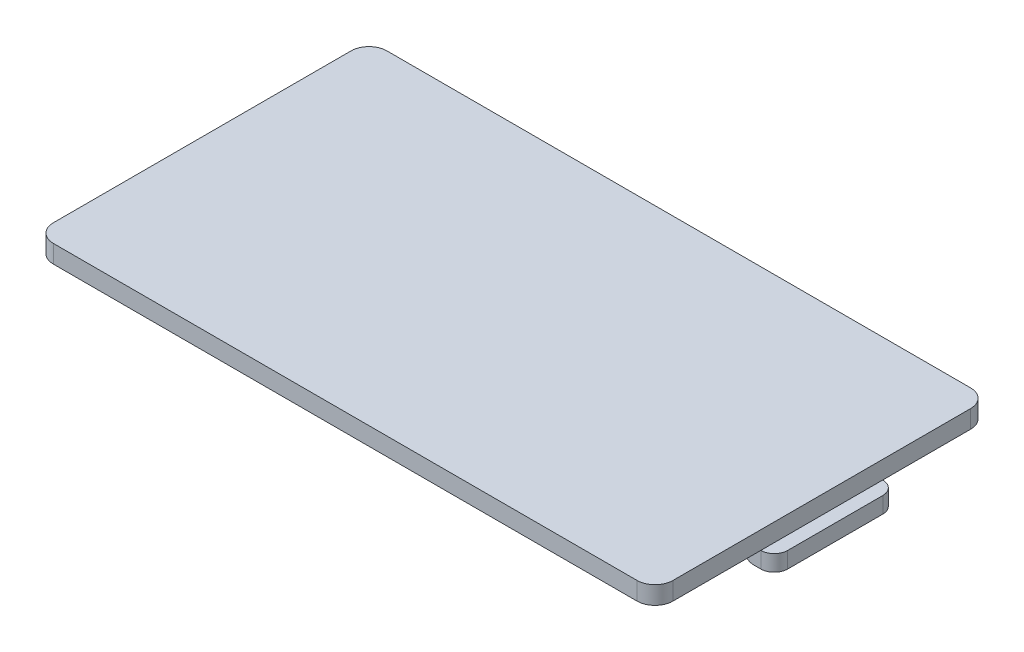
ISO-10303-21;
HEADER;
FILE_DESCRIPTION(('STEP AP214'),'2;1');
FILE_NAME('part.step','',(''),(''),'','','');
FILE_SCHEMA(('AUTOMOTIVE_DESIGN { 1 0 10303 214 1 1 1 1 }'));
ENDSEC;
DATA;
#1=APPLICATION_CONTEXT('core data for automotive mechanical design processes');
#2=APPLICATION_PROTOCOL_DEFINITION('international standard','automotive_design',2000,#1);
#3=PRODUCT_CONTEXT('',#1,'mechanical');
#4=PRODUCT('Part','Part','',(#3));
#5=PRODUCT_RELATED_PRODUCT_CATEGORY('part','',(#4));
#6=PRODUCT_DEFINITION_FORMATION('','',#4);
#7=PRODUCT_DEFINITION_CONTEXT('part definition',#1,'design');
#8=PRODUCT_DEFINITION('design','',#6,#7);
#9=PRODUCT_DEFINITION_SHAPE('','',#8);
#10=(LENGTH_UNIT() NAMED_UNIT(*) SI_UNIT(.MILLI.,.METRE.));
#11=(NAMED_UNIT(*) PLANE_ANGLE_UNIT() SI_UNIT($,.RADIAN.));
#12=(NAMED_UNIT(*) SI_UNIT($,.STERADIAN.) SOLID_ANGLE_UNIT());
#13=UNCERTAINTY_MEASURE_WITH_UNIT(LENGTH_MEASURE(1.E-05),#10,'distance_accuracy_value','');
#14=(GEOMETRIC_REPRESENTATION_CONTEXT(3) GLOBAL_UNCERTAINTY_ASSIGNED_CONTEXT((#13)) GLOBAL_UNIT_ASSIGNED_CONTEXT((#10,
#11,#12)) REPRESENTATION_CONTEXT('',''));
#15=CARTESIAN_POINT('',(0.,0.,0.));
#16=DIRECTION('',(0.,0.,1.));
#17=DIRECTION('',(1.,0.,0.));
#18=AXIS2_PLACEMENT_3D('',#15,#16,#17);
#19=CARTESIAN_POINT('',(0.,0.,0.));
#20=DIRECTION('',(0.,1.,0.));
#21=DIRECTION('',(0.,0.,1.));
#22=AXIS2_PLACEMENT_3D('',#19,#20,#21);
#23=PLANE('',#22);
#24=DIRECTION('',(0.,0.,1.));
#25=VECTOR('',#24,1.);
#26=CARTESIAN_POINT('',(34.55,0.,0.));
#27=LINE('',#26,#25);
#28=CARTESIAN_POINT('',(34.55,0.,6.80000000000001));
#29=VERTEX_POINT('',#28);
#30=CARTESIAN_POINT('',(34.55,0.,16.6));
#31=VERTEX_POINT('',#30);
#32=EDGE_CURVE('E209',#29,#31,#27,.T.);
#33=ORIENTED_EDGE('',*,*,#32,.T.);
#34=CARTESIAN_POINT('',(32.55,0.,16.6));
#35=DIRECTION('',(0.,1.,0.));
#36=DIRECTION('',(0.,0.,1.));
#37=AXIS2_PLACEMENT_3D('',#34,#35,#36);
#38=CIRCLE('',#37,2.);
#39=CARTESIAN_POINT('',(32.55,0.,18.6));
#40=VERTEX_POINT('',#39);
#41=EDGE_CURVE('E235',#31,#40,#38,.F.);
#42=ORIENTED_EDGE('',*,*,#41,.T.);
#43=DIRECTION('',(1.,0.,0.));
#44=VECTOR('',#43,1.);
#45=CARTESIAN_POINT('',(0.,0.,18.6));
#46=LINE('',#45,#44);
#47=CARTESIAN_POINT('',(-32.55,0.,18.6));
#48=VERTEX_POINT('',#47);
#49=EDGE_CURVE('E192',#48,#40,#46,.T.);
#50=ORIENTED_EDGE('',*,*,#49,.F.);
#51=CARTESIAN_POINT('',(-32.55,0.,16.6));
#52=DIRECTION('',(0.,1.,0.));
#53=DIRECTION('',(0.,0.,1.));
#54=AXIS2_PLACEMENT_3D('',#51,#52,#53);
#55=CIRCLE('',#54,2.);
#56=CARTESIAN_POINT('',(-34.55,0.,16.6));
#57=VERTEX_POINT('',#56);
#58=EDGE_CURVE('E232',#48,#57,#55,.F.);
#59=ORIENTED_EDGE('',*,*,#58,.T.);
#60=DIRECTION('',(0.,0.,1.));
#61=VECTOR('',#60,1.);
#62=CARTESIAN_POINT('',(-34.55,0.,0.));
#63=LINE('',#62,#61);
#64=CARTESIAN_POINT('',(-34.55,0.,-16.6));
#65=VERTEX_POINT('',#64);
#66=EDGE_CURVE('E199',#65,#57,#63,.T.);
#67=ORIENTED_EDGE('',*,*,#66,.F.);
#68=CARTESIAN_POINT('',(-32.55,0.,-16.6));
#69=DIRECTION('',(0.,1.,0.));
#70=DIRECTION('',(0.,0.,1.));
#71=AXIS2_PLACEMENT_3D('',#68,#69,#70);
#72=CIRCLE('',#71,2.);
#73=CARTESIAN_POINT('',(-32.55,0.,-18.6));
#74=VERTEX_POINT('',#73);
#75=EDGE_CURVE('E229',#65,#74,#72,.F.);
#76=ORIENTED_EDGE('',*,*,#75,.T.);
#77=DIRECTION('',(1.,0.,0.));
#78=VECTOR('',#77,1.);
#79=CARTESIAN_POINT('',(0.,0.,-18.6));
#80=LINE('',#79,#78);
#81=CARTESIAN_POINT('',(32.55,0.,-18.6));
#82=VERTEX_POINT('',#81);
#83=EDGE_CURVE('E212',#74,#82,#80,.T.);
#84=ORIENTED_EDGE('',*,*,#83,.T.);
#85=CARTESIAN_POINT('',(32.55,0.,-16.6));
#86=DIRECTION('',(0.,1.,0.));
#87=DIRECTION('',(0.,0.,1.));
#88=AXIS2_PLACEMENT_3D('',#85,#86,#87);
#89=CIRCLE('',#88,2.);
#90=CARTESIAN_POINT('',(34.55,0.,-16.6));
#91=VERTEX_POINT('',#90);
#92=EDGE_CURVE('E226',#82,#91,#89,.F.);
#93=ORIENTED_EDGE('',*,*,#92,.T.);
#94=CARTESIAN_POINT('',(34.55,0.,-6.79999999999998));
#95=VERTEX_POINT('',#94);
#96=EDGE_CURVE('E177',#91,#95,#27,.T.);
#97=ORIENTED_EDGE('',*,*,#96,.T.);
#98=DIRECTION('',(-1.,0.,0.));
#99=VECTOR('',#98,1.);
#100=CARTESIAN_POINT('',(0.,0.,-6.79999999999997));
#101=LINE('',#100,#99);
#102=CARTESIAN_POINT('',(32.55,0.,-6.79999999999998));
#103=VERTEX_POINT('',#102);
#104=EDGE_CURVE('E153',#95,#103,#101,.T.);
#105=ORIENTED_EDGE('',*,*,#104,.T.);
#106=DIRECTION('',(0.,0.,1.));
#107=VECTOR('',#106,1.);
#108=CARTESIAN_POINT('',(32.55,0.,0.));
#109=LINE('',#108,#107);
#110=CARTESIAN_POINT('',(32.55,0.,6.80000000000001));
#111=VERTEX_POINT('',#110);
#112=EDGE_CURVE('E164',#103,#111,#109,.T.);
#113=ORIENTED_EDGE('',*,*,#112,.T.);
#114=DIRECTION('',(-1.,0.,0.));
#115=VECTOR('',#114,1.);
#116=CARTESIAN_POINT('',(0.,0.,6.80000000000001));
#117=LINE('',#116,#115);
#118=EDGE_CURVE('E179',#29,#111,#117,.T.);
#119=ORIENTED_EDGE('',*,*,#118,.F.);
#120=EDGE_LOOP('',(#33,#42,#50,#59,#67,#76,#84,#93,#97,#105,#113,#119));
#121=FACE_BOUND('',#120,.T.);
#122=CARTESIAN_POINT('',(-29.75,0.,-7.1));
#123=DIRECTION('',(0.,1.,0.));
#124=DIRECTION('',(0.,0.,1.));
#125=AXIS2_PLACEMENT_3D('',#122,#123,#124);
#126=CIRCLE('',#125,2.6);
#127=CARTESIAN_POINT('',(-29.75,0.,-4.5));
#128=VERTEX_POINT('',#127);
#129=EDGE_CURVE('E335',#128,#128,#126,.T.);
#130=ORIENTED_EDGE('',*,*,#129,.T.);
#131=EDGE_LOOP('',(#130));
#132=FACE_BOUND('',#131,.T.);
#133=CARTESIAN_POINT('',(-29.75,0.,7.1));
#134=DIRECTION('',(0.,1.,0.));
#135=DIRECTION('',(0.,0.,1.));
#136=AXIS2_PLACEMENT_3D('',#133,#134,#135);
#137=CIRCLE('',#136,2.6);
#138=CARTESIAN_POINT('',(-29.75,0.,9.7));
#139=VERTEX_POINT('',#138);
#140=EDGE_CURVE('E343',#139,#139,#137,.F.);
#141=ORIENTED_EDGE('',*,*,#140,.F.);
#142=EDGE_LOOP('',(#141));
#143=FACE_BOUND('',#142,.T.);
#144=ADVANCED_FACE('F41',(#121,#132,#143),#23,.F.);
#145=CARTESIAN_POINT('',(0.,2.,18.6));
#146=DIRECTION('',(0.,0.,-1.));
#147=DIRECTION('',(-1.,0.,0.));
#148=AXIS2_PLACEMENT_3D('',#145,#146,#147);
#149=PLANE('',#148);
#150=ORIENTED_EDGE('',*,*,#49,.T.);
#151=DIRECTION('',(0.,-1.,0.));
#152=VECTOR('',#151,1.);
#153=CARTESIAN_POINT('',(32.55,2.,18.6));
#154=LINE('',#153,#152);
#155=CARTESIAN_POINT('',(32.55,2.,18.6));
#156=VERTEX_POINT('',#155);
#157=EDGE_CURVE('E242',#40,#156,#154,.F.);
#158=ORIENTED_EDGE('',*,*,#157,.T.);
#159=DIRECTION('',(1.,0.,0.));
#160=VECTOR('',#159,1.);
#161=CARTESIAN_POINT('',(0.,2.,18.6));
#162=LINE('',#161,#160);
#163=CARTESIAN_POINT('',(-32.55,2.,18.6));
#164=VERTEX_POINT('',#163);
#165=EDGE_CURVE('E194',#164,#156,#162,.T.);
#166=ORIENTED_EDGE('',*,*,#165,.F.);
#167=DIRECTION('',(0.,-1.,0.));
#168=VECTOR('',#167,1.);
#169=CARTESIAN_POINT('',(-32.55,2.,18.6));
#170=LINE('',#169,#168);
#171=EDGE_CURVE('E238',#164,#48,#170,.T.);
#172=ORIENTED_EDGE('',*,*,#171,.T.);
#173=EDGE_LOOP('',(#150,#158,#166,#172));
#174=FACE_BOUND('',#173,.T.);
#175=ADVANCED_FACE('F363',(#174),#149,.F.);
#176=CARTESIAN_POINT('',(34.55,2.,0.));
#177=DIRECTION('',(1.,0.,0.));
#178=DIRECTION('',(0.,0.,-1.));
#179=AXIS2_PLACEMENT_3D('',#176,#177,#178);
#180=PLANE('',#179);
#181=DIRECTION('',(0.,0.,1.));
#182=VECTOR('',#181,1.);
#183=CARTESIAN_POINT('',(34.55,2.,0.));
#184=LINE('',#183,#182);
#185=CARTESIAN_POINT('',(34.55,2.,-16.6));
#186=VERTEX_POINT('',#185);
#187=CARTESIAN_POINT('',(34.55,2.,16.6));
#188=VERTEX_POINT('',#187);
#189=EDGE_CURVE('E198',#186,#188,#184,.T.);
#190=ORIENTED_EDGE('',*,*,#189,.T.);
#191=DIRECTION('',(0.,-1.,0.));
#192=VECTOR('',#191,1.);
#193=CARTESIAN_POINT('',(34.55,0.,16.6));
#194=LINE('',#193,#192);
#195=EDGE_CURVE('E222',#188,#31,#194,.T.);
#196=ORIENTED_EDGE('',*,*,#195,.T.);
#197=ORIENTED_EDGE('',*,*,#32,.F.);
#198=EDGE_CURVE('E213',#95,#29,#27,.T.);
#199=ORIENTED_EDGE('',*,*,#198,.F.);
#200=ORIENTED_EDGE('',*,*,#96,.F.);
#201=DIRECTION('',(0.,-1.,0.));
#202=VECTOR('',#201,1.);
#203=CARTESIAN_POINT('',(34.55,2.,-16.6));
#204=LINE('',#203,#202);
#205=EDGE_CURVE('E184',#91,#186,#204,.F.);
#206=ORIENTED_EDGE('',*,*,#205,.T.);
#207=EDGE_LOOP('',(#190,#196,#197,#199,#200,#206));
#208=FACE_BOUND('',#207,.T.);
#209=ADVANCED_FACE('F308',(#208),#180,.T.);
#210=CARTESIAN_POINT('',(0.,2.,-18.6));
#211=DIRECTION('',(0.,0.,-1.));
#212=DIRECTION('',(-1.,0.,0.));
#213=AXIS2_PLACEMENT_3D('',#210,#211,#212);
#214=PLANE('',#213);
#215=ORIENTED_EDGE('',*,*,#83,.F.);
#216=DIRECTION('',(0.,-1.,0.));
#217=VECTOR('',#216,1.);
#218=CARTESIAN_POINT('',(-32.55,2.,-18.6));
#219=LINE('',#218,#217);
#220=CARTESIAN_POINT('',(-32.55,2.,-18.6));
#221=VERTEX_POINT('',#220);
#222=EDGE_CURVE('E268',#74,#221,#219,.F.);
#223=ORIENTED_EDGE('',*,*,#222,.T.);
#224=DIRECTION('',(1.,0.,0.));
#225=VECTOR('',#224,1.);
#226=CARTESIAN_POINT('',(0.,2.,-18.6));
#227=LINE('',#226,#225);
#228=CARTESIAN_POINT('',(32.55,2.,-18.6));
#229=VERTEX_POINT('',#228);
#230=EDGE_CURVE('E187',#221,#229,#227,.T.);
#231=ORIENTED_EDGE('',*,*,#230,.T.);
#232=DIRECTION('',(0.,-1.,0.));
#233=VECTOR('',#232,1.);
#234=CARTESIAN_POINT('',(32.55,2.,-18.6));
#235=LINE('',#234,#233);
#236=EDGE_CURVE('E264',#229,#82,#235,.T.);
#237=ORIENTED_EDGE('',*,*,#236,.T.);
#238=EDGE_LOOP('',(#215,#223,#231,#237));
#239=FACE_BOUND('',#238,.T.);
#240=ADVANCED_FACE('F377',(#239),#214,.T.);
#241=CARTESIAN_POINT('',(-34.55,2.,0.));
#242=DIRECTION('',(1.,0.,0.));
#243=DIRECTION('',(0.,0.,-1.));
#244=AXIS2_PLACEMENT_3D('',#241,#242,#243);
#245=PLANE('',#244);
#246=ORIENTED_EDGE('',*,*,#66,.T.);
#247=DIRECTION('',(0.,-1.,0.));
#248=VECTOR('',#247,1.);
#249=CARTESIAN_POINT('',(-34.55,2.,16.6));
#250=LINE('',#249,#248);
#251=CARTESIAN_POINT('',(-34.55,2.,16.6));
#252=VERTEX_POINT('',#251);
#253=EDGE_CURVE('E261',#57,#252,#250,.F.);
#254=ORIENTED_EDGE('',*,*,#253,.T.);
#255=DIRECTION('',(0.,0.,1.));
#256=VECTOR('',#255,1.);
#257=CARTESIAN_POINT('',(-34.55,2.,0.));
#258=LINE('',#257,#256);
#259=CARTESIAN_POINT('',(-34.55,2.,-16.6));
#260=VERTEX_POINT('',#259);
#261=EDGE_CURVE('E180',#260,#252,#258,.T.);
#262=ORIENTED_EDGE('',*,*,#261,.F.);
#263=DIRECTION('',(0.,-1.,0.));
#264=VECTOR('',#263,1.);
#265=CARTESIAN_POINT('',(-34.55,0.,-16.6));
#266=LINE('',#265,#264);
#267=EDGE_CURVE('E257',#260,#65,#266,.T.);
#268=ORIENTED_EDGE('',*,*,#267,.T.);
#269=EDGE_LOOP('',(#246,#254,#262,#268));
#270=FACE_BOUND('',#269,.T.);
#271=ADVANCED_FACE('F374',(#270),#245,.F.);
#272=CARTESIAN_POINT('',(0.,2.,0.));
#273=DIRECTION('',(0.,1.,0.));
#274=DIRECTION('',(0.,0.,1.));
#275=AXIS2_PLACEMENT_3D('',#272,#273,#274);
#276=PLANE('',#275);
#277=ORIENTED_EDGE('',*,*,#165,.T.);
#278=CARTESIAN_POINT('',(32.55,2.,16.6));
#279=DIRECTION('',(0.,1.,0.));
#280=DIRECTION('',(0.,0.,1.));
#281=AXIS2_PLACEMENT_3D('',#278,#279,#280);
#282=CIRCLE('',#281,2.);
#283=EDGE_CURVE('E254',#156,#188,#282,.T.);
#284=ORIENTED_EDGE('',*,*,#283,.T.);
#285=ORIENTED_EDGE('',*,*,#189,.F.);
#286=CARTESIAN_POINT('',(32.55,2.,-16.6));
#287=DIRECTION('',(0.,1.,0.));
#288=DIRECTION('',(0.,0.,1.));
#289=AXIS2_PLACEMENT_3D('',#286,#287,#288);
#290=CIRCLE('',#289,2.);
#291=EDGE_CURVE('E245',#186,#229,#290,.T.);
#292=ORIENTED_EDGE('',*,*,#291,.T.);
#293=ORIENTED_EDGE('',*,*,#230,.F.);
#294=CARTESIAN_POINT('',(-32.55,2.,-16.6));
#295=DIRECTION('',(0.,1.,0.));
#296=DIRECTION('',(0.,0.,1.));
#297=AXIS2_PLACEMENT_3D('',#294,#295,#296);
#298=CIRCLE('',#297,2.);
#299=EDGE_CURVE('E248',#221,#260,#298,.T.);
#300=ORIENTED_EDGE('',*,*,#299,.T.);
#301=ORIENTED_EDGE('',*,*,#261,.T.);
#302=CARTESIAN_POINT('',(-32.55,2.,16.6));
#303=DIRECTION('',(0.,1.,0.));
#304=DIRECTION('',(0.,0.,1.));
#305=AXIS2_PLACEMENT_3D('',#302,#303,#304);
#306=CIRCLE('',#305,2.);
#307=EDGE_CURVE('E251',#252,#164,#306,.T.);
#308=ORIENTED_EDGE('',*,*,#307,.T.);
#309=EDGE_LOOP('',(#277,#284,#285,#292,#293,#300,#301,#308));
#310=FACE_BOUND('',#309,.T.);
#311=ADVANCED_FACE('F372',(#310),#276,.T.);
#312=CARTESIAN_POINT('',(0.,-1.8,6.80000000000001));
#313=DIRECTION('',(0.,0.,-1.));
#314=DIRECTION('',(-1.,0.,0.));
#315=AXIS2_PLACEMENT_3D('',#312,#313,#314);
#316=PLANE('',#315);
#317=DIRECTION('',(0.,1.,0.));
#318=VECTOR('',#317,1.);
#319=CARTESIAN_POINT('',(32.55,-1.8,6.80000000000001));
#320=LINE('',#319,#318);
#321=CARTESIAN_POINT('',(32.55,-0.6,6.80000000000001));
#322=VERTEX_POINT('',#321);
#323=EDGE_CURVE('E160',#322,#111,#320,.T.);
#324=ORIENTED_EDGE('',*,*,#323,.F.);
#325=CARTESIAN_POINT('',(33.75,-0.6,6.80000000000001));
#326=DIRECTION('',(0.,0.,-1.));
#327=DIRECTION('',(-1.,0.,0.));
#328=AXIS2_PLACEMENT_3D('',#325,#326,#327);
#329=CIRCLE('',#328,1.2);
#330=CARTESIAN_POINT('',(33.75,-1.8,6.80000000000001));
#331=VERTEX_POINT('',#330);
#332=EDGE_CURVE('E64',#322,#331,#329,.F.);
#333=ORIENTED_EDGE('',*,*,#332,.T.);
#334=DIRECTION('',(-1.,0.,0.));
#335=VECTOR('',#334,1.);
#336=CARTESIAN_POINT('',(0.,-1.8,6.80000000000001));
#337=LINE('',#336,#335);
#338=CARTESIAN_POINT('',(34.55,-1.8,6.80000000000001));
#339=VERTEX_POINT('',#338);
#340=EDGE_CURVE('E170',#339,#331,#337,.T.);
#341=ORIENTED_EDGE('',*,*,#340,.F.);
#342=DIRECTION('',(0.,1.,0.));
#343=VECTOR('',#342,1.);
#344=CARTESIAN_POINT('',(34.55,-1.8,6.80000000000001));
#345=LINE('',#344,#343);
#346=EDGE_CURVE('E293',#339,#29,#345,.T.);
#347=ORIENTED_EDGE('',*,*,#346,.T.);
#348=ORIENTED_EDGE('',*,*,#118,.T.);
#349=EDGE_LOOP('',(#324,#333,#341,#347,#348));
#350=FACE_BOUND('',#349,.T.);
#351=ADVANCED_FACE('F303',(#350),#316,.F.);
#352=CARTESIAN_POINT('',(32.55,-1.8,0.));
#353=DIRECTION('',(-1.,0.,0.));
#354=DIRECTION('',(0.,0.,1.));
#355=AXIS2_PLACEMENT_3D('',#352,#353,#354);
#356=PLANE('',#355);
#357=DIRECTION('',(0.,1.,0.));
#358=VECTOR('',#357,1.);
#359=CARTESIAN_POINT('',(32.55,-1.8,-6.79999999999998));
#360=LINE('',#359,#358);
#361=CARTESIAN_POINT('',(32.55,-0.6,-6.79999999999998));
#362=VERTEX_POINT('',#361);
#363=EDGE_CURVE('E149',#362,#103,#360,.T.);
#364=ORIENTED_EDGE('',*,*,#363,.F.);
#365=DIRECTION('',(0.,0.,1.));
#366=VECTOR('',#365,1.);
#367=CARTESIAN_POINT('',(32.55,-0.6,6.80000000000001));
#368=LINE('',#367,#366);
#369=EDGE_CURVE('E297',#362,#322,#368,.T.);
#370=ORIENTED_EDGE('',*,*,#369,.T.);
#371=ORIENTED_EDGE('',*,*,#323,.T.);
#372=ORIENTED_EDGE('',*,*,#112,.F.);
#373=EDGE_LOOP('',(#364,#370,#371,#372));
#374=FACE_BOUND('',#373,.T.);
#375=ADVANCED_FACE('F165',(#374),#356,.T.);
#376=CARTESIAN_POINT('',(0.,-1.8,-6.79999999999997));
#377=DIRECTION('',(0.,0.,-1.));
#378=DIRECTION('',(-1.,0.,0.));
#379=AXIS2_PLACEMENT_3D('',#376,#377,#378);
#380=PLANE('',#379);
#381=DIRECTION('',(-1.,0.,0.));
#382=VECTOR('',#381,1.);
#383=CARTESIAN_POINT('',(0.,-1.8,-6.79999999999997));
#384=LINE('',#383,#382);
#385=CARTESIAN_POINT('',(34.55,-1.8,-6.79999999999998));
#386=VERTEX_POINT('',#385);
#387=CARTESIAN_POINT('',(33.75,-1.8,-6.79999999999998));
#388=VERTEX_POINT('',#387);
#389=EDGE_CURVE('E161',#386,#388,#384,.T.);
#390=ORIENTED_EDGE('',*,*,#389,.T.);
#391=CARTESIAN_POINT('',(33.75,-0.6,-6.79999999999998));
#392=DIRECTION('',(0.,0.,-1.));
#393=DIRECTION('',(-1.,0.,0.));
#394=AXIS2_PLACEMENT_3D('',#391,#392,#393);
#395=CIRCLE('',#394,1.2);
#396=EDGE_CURVE('E11',#388,#362,#395,.T.);
#397=ORIENTED_EDGE('',*,*,#396,.T.);
#398=ORIENTED_EDGE('',*,*,#363,.T.);
#399=ORIENTED_EDGE('',*,*,#104,.F.);
#400=DIRECTION('',(0.,1.,0.));
#401=VECTOR('',#400,1.);
#402=CARTESIAN_POINT('',(34.55,-1.8,-6.79999999999998));
#403=LINE('',#402,#401);
#404=EDGE_CURVE('E284',#95,#386,#403,.F.);
#405=ORIENTED_EDGE('',*,*,#404,.T.);
#406=EDGE_LOOP('',(#390,#397,#398,#399,#405));
#407=FACE_BOUND('',#406,.T.);
#408=ADVANCED_FACE('F151',(#407),#380,.T.);
#409=CARTESIAN_POINT('',(36.05,-1.8,0.));
#410=DIRECTION('',(-1.,0.,0.));
#411=DIRECTION('',(0.,0.,1.));
#412=AXIS2_PLACEMENT_3D('',#409,#410,#411);
#413=PLANE('',#412);
#414=DIRECTION('',(0.,0.,1.));
#415=VECTOR('',#414,1.);
#416=CARTESIAN_POINT('',(36.05,-1.8,0.));
#417=LINE('',#416,#415);
#418=CARTESIAN_POINT('',(36.05,-1.8,-5.29999999999998));
#419=VERTEX_POINT('',#418);
#420=CARTESIAN_POINT('',(36.05,-1.8,5.30000000000001));
#421=VERTEX_POINT('',#420);
#422=EDGE_CURVE('E326',#419,#421,#417,.T.);
#423=ORIENTED_EDGE('',*,*,#422,.F.);
#424=DIRECTION('',(0.,1.,0.));
#425=VECTOR('',#424,1.);
#426=CARTESIAN_POINT('',(36.05,0.,-5.29999999999998));
#427=LINE('',#426,#425);
#428=CARTESIAN_POINT('',(36.05,0.,-5.29999999999998));
#429=VERTEX_POINT('',#428);
#430=EDGE_CURVE('E274',#419,#429,#427,.T.);
#431=ORIENTED_EDGE('',*,*,#430,.T.);
#432=DIRECTION('',(0.,0.,1.));
#433=VECTOR('',#432,1.);
#434=CARTESIAN_POINT('',(36.05,0.,0.));
#435=LINE('',#434,#433);
#436=CARTESIAN_POINT('',(36.05,0.,5.30000000000001));
#437=VERTEX_POINT('',#436);
#438=EDGE_CURVE('E171',#429,#437,#435,.T.);
#439=ORIENTED_EDGE('',*,*,#438,.T.);
#440=DIRECTION('',(0.,1.,0.));
#441=VECTOR('',#440,1.);
#442=CARTESIAN_POINT('',(36.05,-1.8,5.30000000000001));
#443=LINE('',#442,#441);
#444=EDGE_CURVE('E271',#437,#421,#443,.F.);
#445=ORIENTED_EDGE('',*,*,#444,.T.);
#446=EDGE_LOOP('',(#423,#431,#439,#445));
#447=FACE_BOUND('',#446,.T.);
#448=ADVANCED_FACE('F323',(#447),#413,.F.);
#449=CARTESIAN_POINT('',(0.,-1.8,0.));
#450=DIRECTION('',(0.,1.,0.));
#451=DIRECTION('',(0.,0.,1.));
#452=AXIS2_PLACEMENT_3D('',#449,#450,#451);
#453=PLANE('',#452);
#454=ORIENTED_EDGE('',*,*,#340,.T.);
#455=DIRECTION('',(0.,0.,1.));
#456=VECTOR('',#455,1.);
#457=CARTESIAN_POINT('',(33.75,-1.8,-6.79999999999998));
#458=LINE('',#457,#456);
#459=EDGE_CURVE('E50',#331,#388,#458,.F.);
#460=ORIENTED_EDGE('',*,*,#459,.T.);
#461=ORIENTED_EDGE('',*,*,#389,.F.);
#462=CARTESIAN_POINT('',(34.55,-1.8,-5.29999999999998));
#463=DIRECTION('',(0.,1.,0.));
#464=DIRECTION('',(0.,0.,1.));
#465=AXIS2_PLACEMENT_3D('',#462,#463,#464);
#466=CIRCLE('',#465,1.5);
#467=EDGE_CURVE('E290',#386,#419,#466,.F.);
#468=ORIENTED_EDGE('',*,*,#467,.T.);
#469=ORIENTED_EDGE('',*,*,#422,.T.);
#470=CARTESIAN_POINT('',(34.55,-1.8,5.30000000000001));
#471=DIRECTION('',(0.,1.,0.));
#472=DIRECTION('',(0.,0.,1.));
#473=AXIS2_PLACEMENT_3D('',#470,#471,#472);
#474=CIRCLE('',#473,1.5);
#475=EDGE_CURVE('E287',#421,#339,#474,.F.);
#476=ORIENTED_EDGE('',*,*,#475,.T.);
#477=EDGE_LOOP('',(#454,#460,#461,#468,#469,#476));
#478=FACE_BOUND('',#477,.T.);
#479=ADVANCED_FACE('F407',(#478),#453,.F.);
#480=CARTESIAN_POINT('',(0.,0.,0.));
#481=DIRECTION('',(0.,1.,0.));
#482=DIRECTION('',(0.,0.,1.));
#483=AXIS2_PLACEMENT_3D('',#480,#481,#482);
#484=PLANE('',#483);
#485=ORIENTED_EDGE('',*,*,#438,.F.);
#486=CARTESIAN_POINT('',(34.55,0.,-5.29999999999998));
#487=DIRECTION('',(0.,1.,0.));
#488=DIRECTION('',(0.,0.,1.));
#489=AXIS2_PLACEMENT_3D('',#486,#487,#488);
#490=CIRCLE('',#489,1.5);
#491=EDGE_CURVE('E281',#429,#95,#490,.T.);
#492=ORIENTED_EDGE('',*,*,#491,.T.);
#493=ORIENTED_EDGE('',*,*,#198,.T.);
#494=CARTESIAN_POINT('',(34.55,0.,5.30000000000001));
#495=DIRECTION('',(0.,1.,0.));
#496=DIRECTION('',(0.,0.,1.));
#497=AXIS2_PLACEMENT_3D('',#494,#495,#496);
#498=CIRCLE('',#497,1.5);
#499=EDGE_CURVE('E278',#29,#437,#498,.T.);
#500=ORIENTED_EDGE('',*,*,#499,.T.);
#501=EDGE_LOOP('',(#485,#492,#493,#500));
#502=FACE_BOUND('',#501,.T.);
#503=ADVANCED_FACE('F315',(#502),#484,.T.);
#504=CARTESIAN_POINT('',(-29.75,1.,-7.1));
#505=DIRECTION('',(0.,-1.,0.));
#506=DIRECTION('',(0.,0.,-1.));
#507=AXIS2_PLACEMENT_3D('',#504,#505,#506);
#508=CYLINDRICAL_SURFACE('',#507,2.6);
#509=CARTESIAN_POINT('',(-29.75,1.,-7.1));
#510=DIRECTION('',(0.,1.,0.));
#511=DIRECTION('',(0.,0.,1.));
#512=AXIS2_PLACEMENT_3D('',#509,#510,#511);
#513=CIRCLE('',#512,2.6);
#514=CARTESIAN_POINT('',(-29.75,1.,-4.5));
#515=VERTEX_POINT('',#514);
#516=EDGE_CURVE('E339',#515,#515,#513,.T.);
#517=ORIENTED_EDGE('',*,*,#516,.T.);
#518=EDGE_LOOP('',(#517));
#519=FACE_BOUND('',#518,.T.);
#520=ORIENTED_EDGE('',*,*,#129,.F.);
#521=EDGE_LOOP('',(#520));
#522=FACE_BOUND('',#521,.T.);
#523=ADVANCED_FACE('F414',(#519,#522),#508,.F.);
#524=CARTESIAN_POINT('',(0.,1.,0.));
#525=DIRECTION('',(0.,1.,0.));
#526=DIRECTION('',(0.,0.,1.));
#527=AXIS2_PLACEMENT_3D('',#524,#525,#526);
#528=PLANE('',#527);
#529=ORIENTED_EDGE('',*,*,#516,.F.);
#530=EDGE_LOOP('',(#529));
#531=FACE_BOUND('',#530,.T.);
#532=ADVANCED_FACE('F358',(#531),#528,.F.);
#533=CARTESIAN_POINT('',(-29.75,1.,7.1));
#534=DIRECTION('',(0.,-1.,0.));
#535=DIRECTION('',(0.,0.,-1.));
#536=AXIS2_PLACEMENT_3D('',#533,#534,#535);
#537=CYLINDRICAL_SURFACE('',#536,2.6);
#538=CARTESIAN_POINT('',(-29.75,1.,7.1));
#539=DIRECTION('',(0.,1.,0.));
#540=DIRECTION('',(0.,0.,1.));
#541=AXIS2_PLACEMENT_3D('',#538,#539,#540);
#542=CIRCLE('',#541,2.6);
#543=CARTESIAN_POINT('',(-29.75,1.,9.7));
#544=VERTEX_POINT('',#543);
#545=EDGE_CURVE('E347',#544,#544,#542,.F.);
#546=ORIENTED_EDGE('',*,*,#545,.F.);
#547=EDGE_LOOP('',(#546));
#548=FACE_BOUND('',#547,.T.);
#549=ORIENTED_EDGE('',*,*,#140,.T.);
#550=EDGE_LOOP('',(#549));
#551=FACE_BOUND('',#550,.T.);
#552=ADVANCED_FACE('F355',(#548,#551),#537,.F.);
#553=CARTESIAN_POINT('',(0.,1.,0.));
#554=DIRECTION('',(0.,1.,0.));
#555=DIRECTION('',(0.,0.,1.));
#556=AXIS2_PLACEMENT_3D('',#553,#554,#555);
#557=PLANE('',#556);
#558=ORIENTED_EDGE('',*,*,#545,.T.);
#559=EDGE_LOOP('',(#558));
#560=FACE_BOUND('',#559,.T.);
#561=ADVANCED_FACE('F353',(#560),#557,.F.);
#562=CARTESIAN_POINT('',(32.55,2.,16.6));
#563=DIRECTION('',(0.,1.,0.));
#564=DIRECTION('',(0.,0.,1.));
#565=AXIS2_PLACEMENT_3D('',#562,#563,#564);
#566=CYLINDRICAL_SURFACE('',#565,2.);
#567=ORIENTED_EDGE('',*,*,#283,.F.);
#568=ORIENTED_EDGE('',*,*,#157,.F.);
#569=ORIENTED_EDGE('',*,*,#41,.F.);
#570=ORIENTED_EDGE('',*,*,#195,.F.);
#571=EDGE_LOOP('',(#567,#568,#569,#570));
#572=FACE_BOUND('',#571,.T.);
#573=ADVANCED_FACE('F384',(#572),#566,.T.);
#574=CARTESIAN_POINT('',(-32.55,2.,16.6));
#575=DIRECTION('',(0.,-1.,0.));
#576=DIRECTION('',(0.,0.,-1.));
#577=AXIS2_PLACEMENT_3D('',#574,#575,#576);
#578=CYLINDRICAL_SURFACE('',#577,2.);
#579=ORIENTED_EDGE('',*,*,#307,.F.);
#580=ORIENTED_EDGE('',*,*,#253,.F.);
#581=ORIENTED_EDGE('',*,*,#58,.F.);
#582=ORIENTED_EDGE('',*,*,#171,.F.);
#583=EDGE_LOOP('',(#579,#580,#581,#582));
#584=FACE_BOUND('',#583,.T.);
#585=ADVANCED_FACE('F387',(#584),#578,.T.);
#586=CARTESIAN_POINT('',(-32.55,2.,-16.6));
#587=DIRECTION('',(0.,1.,0.));
#588=DIRECTION('',(0.,0.,1.));
#589=AXIS2_PLACEMENT_3D('',#586,#587,#588);
#590=CYLINDRICAL_SURFACE('',#589,2.);
#591=ORIENTED_EDGE('',*,*,#299,.F.);
#592=ORIENTED_EDGE('',*,*,#222,.F.);
#593=ORIENTED_EDGE('',*,*,#75,.F.);
#594=ORIENTED_EDGE('',*,*,#267,.F.);
#595=EDGE_LOOP('',(#591,#592,#593,#594));
#596=FACE_BOUND('',#595,.T.);
#597=ADVANCED_FACE('F391',(#596),#590,.T.);
#598=CARTESIAN_POINT('',(32.55,2.,-16.6));
#599=DIRECTION('',(0.,-1.,0.));
#600=DIRECTION('',(0.,0.,-1.));
#601=AXIS2_PLACEMENT_3D('',#598,#599,#600);
#602=CYLINDRICAL_SURFACE('',#601,2.);
#603=ORIENTED_EDGE('',*,*,#291,.F.);
#604=ORIENTED_EDGE('',*,*,#205,.F.);
#605=ORIENTED_EDGE('',*,*,#92,.F.);
#606=ORIENTED_EDGE('',*,*,#236,.F.);
#607=EDGE_LOOP('',(#603,#604,#605,#606));
#608=FACE_BOUND('',#607,.T.);
#609=ADVANCED_FACE('F395',(#608),#602,.T.);
#610=CARTESIAN_POINT('',(34.55,-1.8,-5.29999999999998));
#611=DIRECTION('',(0.,-1.,0.));
#612=DIRECTION('',(0.,0.,-1.));
#613=AXIS2_PLACEMENT_3D('',#610,#611,#612);
#614=CYLINDRICAL_SURFACE('',#613,1.5);
#615=ORIENTED_EDGE('',*,*,#467,.F.);
#616=ORIENTED_EDGE('',*,*,#404,.F.);
#617=ORIENTED_EDGE('',*,*,#491,.F.);
#618=ORIENTED_EDGE('',*,*,#430,.F.);
#619=EDGE_LOOP('',(#615,#616,#617,#618));
#620=FACE_BOUND('',#619,.T.);
#621=ADVANCED_FACE('F320',(#620),#614,.T.);
#622=CARTESIAN_POINT('',(34.55,-1.8,5.30000000000001));
#623=DIRECTION('',(0.,1.,0.));
#624=DIRECTION('',(0.,0.,1.));
#625=AXIS2_PLACEMENT_3D('',#622,#623,#624);
#626=CYLINDRICAL_SURFACE('',#625,1.5);
#627=ORIENTED_EDGE('',*,*,#475,.F.);
#628=ORIENTED_EDGE('',*,*,#444,.F.);
#629=ORIENTED_EDGE('',*,*,#499,.F.);
#630=ORIENTED_EDGE('',*,*,#346,.F.);
#631=EDGE_LOOP('',(#627,#628,#629,#630));
#632=FACE_BOUND('',#631,.T.);
#633=ADVANCED_FACE('F401',(#632),#626,.T.);
#634=CARTESIAN_POINT('',(33.75,-0.6,0.));
#635=DIRECTION('',(0.,0.,-1.));
#636=DIRECTION('',(-1.,0.,0.));
#637=AXIS2_PLACEMENT_3D('',#634,#635,#636);
#638=CYLINDRICAL_SURFACE('',#637,1.2);
#639=ORIENTED_EDGE('',*,*,#396,.F.);
#640=ORIENTED_EDGE('',*,*,#459,.F.);
#641=ORIENTED_EDGE('',*,*,#332,.F.);
#642=ORIENTED_EDGE('',*,*,#369,.F.);
#643=EDGE_LOOP('',(#639,#640,#641,#642));
#644=FACE_BOUND('',#643,.T.);
#645=ADVANCED_FACE('F43',(#644),#638,.T.);
#646=CLOSED_SHELL('',(#144,#175,#209,#240,#271,#311,#351,#375,#408,#448,#479,#503,#523,#532,
#552,#561,#573,#585,#597,#609,#621,#633,#645));
#647=MANIFOLD_SOLID_BREP('B2',#646);
#648=ADVANCED_BREP_SHAPE_REPRESENTATION('',(#18,#647),#14);
#649=SHAPE_DEFINITION_REPRESENTATION(#9,#648);
ENDSEC;
END-ISO-10303-21;
